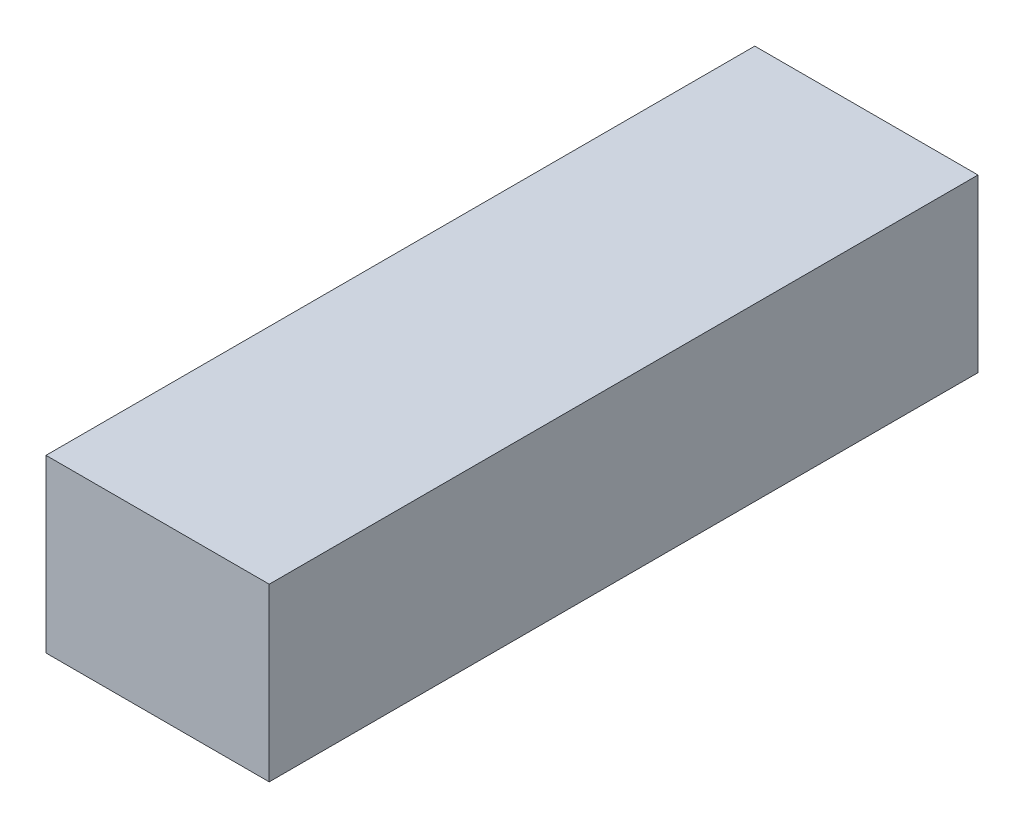
ISO-10303-21;
HEADER;
FILE_DESCRIPTION(('STEP AP214'),'2;1');
FILE_NAME('part.step','',(''),(''),'','','');
FILE_SCHEMA(('AUTOMOTIVE_DESIGN { 1 0 10303 214 1 1 1 1 }'));
ENDSEC;
DATA;
#1=APPLICATION_CONTEXT('core data for automotive mechanical design processes');
#2=APPLICATION_PROTOCOL_DEFINITION('international standard','automotive_design',2000,#1);
#3=PRODUCT_CONTEXT('',#1,'mechanical');
#4=PRODUCT('Part','Part','',(#3));
#5=PRODUCT_RELATED_PRODUCT_CATEGORY('part','',(#4));
#6=PRODUCT_DEFINITION_FORMATION('','',#4);
#7=PRODUCT_DEFINITION_CONTEXT('part definition',#1,'design');
#8=PRODUCT_DEFINITION('design','',#6,#7);
#9=PRODUCT_DEFINITION_SHAPE('','',#8);
#10=(LENGTH_UNIT() NAMED_UNIT(*) SI_UNIT(.MILLI.,.METRE.));
#11=(NAMED_UNIT(*) PLANE_ANGLE_UNIT() SI_UNIT($,.RADIAN.));
#12=(NAMED_UNIT(*) SI_UNIT($,.STERADIAN.) SOLID_ANGLE_UNIT());
#13=UNCERTAINTY_MEASURE_WITH_UNIT(LENGTH_MEASURE(1.E-05),#10,'distance_accuracy_value','');
#14=(GEOMETRIC_REPRESENTATION_CONTEXT(3) GLOBAL_UNCERTAINTY_ASSIGNED_CONTEXT((#13)) GLOBAL_UNIT_ASSIGNED_CONTEXT((#10,
#11,#12)) REPRESENTATION_CONTEXT('',''));
#15=CARTESIAN_POINT('',(0.,0.,0.));
#16=DIRECTION('',(0.,0.,1.));
#17=DIRECTION('',(1.,0.,0.));
#18=AXIS2_PLACEMENT_3D('',#15,#16,#17);
#19=CARTESIAN_POINT('',(24.25,-18.6,154.));
#20=DIRECTION('',(-1.,0.,0.));
#21=DIRECTION('',(0.,0.,1.));
#22=AXIS2_PLACEMENT_3D('',#19,#20,#21);
#23=PLANE('',#22);
#24=DIRECTION('',(0.,1.,0.));
#25=VECTOR('',#24,1.);
#26=CARTESIAN_POINT('',(24.25,-18.6,0.));
#27=LINE('',#26,#25);
#28=CARTESIAN_POINT('',(24.25,-18.6,0.));
#29=VERTEX_POINT('',#28);
#30=CARTESIAN_POINT('',(24.25,18.6,0.));
#31=VERTEX_POINT('',#30);
#32=EDGE_CURVE('E95',#29,#31,#27,.T.);
#33=ORIENTED_EDGE('',*,*,#32,.T.);
#34=DIRECTION('',(0.,0.,-1.));
#35=VECTOR('',#34,1.);
#36=CARTESIAN_POINT('',(24.25,18.6,154.));
#37=LINE('',#36,#35);
#38=CARTESIAN_POINT('',(24.25,18.6,154.));
#39=VERTEX_POINT('',#38);
#40=EDGE_CURVE('E11',#39,#31,#37,.T.);
#41=ORIENTED_EDGE('',*,*,#40,.F.);
#42=DIRECTION('',(0.,1.,0.));
#43=VECTOR('',#42,1.);
#44=CARTESIAN_POINT('',(24.25,-18.6,154.));
#45=LINE('',#44,#43);
#46=CARTESIAN_POINT('',(24.25,-18.6,154.));
#47=VERTEX_POINT('',#46);
#48=EDGE_CURVE('E83',#47,#39,#45,.T.);
#49=ORIENTED_EDGE('',*,*,#48,.F.);
#50=DIRECTION('',(0.,0.,-1.));
#51=VECTOR('',#50,1.);
#52=CARTESIAN_POINT('',(24.25,-18.6,154.));
#53=LINE('',#52,#51);
#54=EDGE_CURVE('E91',#47,#29,#53,.T.);
#55=ORIENTED_EDGE('',*,*,#54,.T.);
#56=EDGE_LOOP('',(#33,#41,#49,#55));
#57=FACE_BOUND('',#56,.T.);
#58=ADVANCED_FACE('F32',(#57),#23,.F.);
#59=CARTESIAN_POINT('',(-24.25,18.6,154.));
#60=DIRECTION('',(0.,-1.,0.));
#61=DIRECTION('',(0.,0.,-1.));
#62=AXIS2_PLACEMENT_3D('',#59,#60,#61);
#63=PLANE('',#62);
#64=DIRECTION('',(-1.,0.,0.));
#65=VECTOR('',#64,1.);
#66=CARTESIAN_POINT('',(-24.25,18.6,0.));
#67=LINE('',#66,#65);
#68=CARTESIAN_POINT('',(-24.25,18.6,0.));
#69=VERTEX_POINT('',#68);
#70=EDGE_CURVE('E87',#31,#69,#67,.T.);
#71=ORIENTED_EDGE('',*,*,#70,.T.);
#72=DIRECTION('',(0.,0.,-1.));
#73=VECTOR('',#72,1.);
#74=CARTESIAN_POINT('',(-24.25,18.6,154.));
#75=LINE('',#74,#73);
#76=CARTESIAN_POINT('',(-24.25,18.6,154.));
#77=VERTEX_POINT('',#76);
#78=EDGE_CURVE('E40',#77,#69,#75,.T.);
#79=ORIENTED_EDGE('',*,*,#78,.F.);
#80=DIRECTION('',(-1.,0.,0.));
#81=VECTOR('',#80,1.);
#82=CARTESIAN_POINT('',(-24.25,18.6,154.));
#83=LINE('',#82,#81);
#84=EDGE_CURVE('E78',#39,#77,#83,.T.);
#85=ORIENTED_EDGE('',*,*,#84,.F.);
#86=ORIENTED_EDGE('',*,*,#40,.T.);
#87=EDGE_LOOP('',(#71,#79,#85,#86));
#88=FACE_BOUND('',#87,.T.);
#89=ADVANCED_FACE('F86',(#88),#63,.F.);
#90=CARTESIAN_POINT('',(-24.25,-18.6,154.));
#91=DIRECTION('',(1.,0.,0.));
#92=DIRECTION('',(0.,0.,-1.));
#93=AXIS2_PLACEMENT_3D('',#90,#91,#92);
#94=PLANE('',#93);
#95=DIRECTION('',(0.,-1.,0.));
#96=VECTOR('',#95,1.);
#97=CARTESIAN_POINT('',(-24.25,-18.6,0.));
#98=LINE('',#97,#96);
#99=CARTESIAN_POINT('',(-24.25,-18.6,0.));
#100=VERTEX_POINT('',#99);
#101=EDGE_CURVE('E65',#69,#100,#98,.T.);
#102=ORIENTED_EDGE('',*,*,#101,.T.);
#103=DIRECTION('',(0.,0.,-1.));
#104=VECTOR('',#103,1.);
#105=CARTESIAN_POINT('',(-24.25,-18.6,154.));
#106=LINE('',#105,#104);
#107=CARTESIAN_POINT('',(-24.25,-18.6,154.));
#108=VERTEX_POINT('',#107);
#109=EDGE_CURVE('E88',#108,#100,#106,.T.);
#110=ORIENTED_EDGE('',*,*,#109,.F.);
#111=DIRECTION('',(0.,-1.,0.));
#112=VECTOR('',#111,1.);
#113=CARTESIAN_POINT('',(-24.25,-18.6,154.));
#114=LINE('',#113,#112);
#115=EDGE_CURVE('E81',#77,#108,#114,.T.);
#116=ORIENTED_EDGE('',*,*,#115,.F.);
#117=ORIENTED_EDGE('',*,*,#78,.T.);
#118=EDGE_LOOP('',(#102,#110,#116,#117));
#119=FACE_BOUND('',#118,.T.);
#120=ADVANCED_FACE('F89',(#119),#94,.F.);
#121=CARTESIAN_POINT('',(-24.25,-18.6,154.));
#122=DIRECTION('',(0.,1.,0.));
#123=DIRECTION('',(0.,0.,1.));
#124=AXIS2_PLACEMENT_3D('',#121,#122,#123);
#125=PLANE('',#124);
#126=DIRECTION('',(1.,0.,0.));
#127=VECTOR('',#126,1.);
#128=CARTESIAN_POINT('',(-24.25,-18.6,0.));
#129=LINE('',#128,#127);
#130=EDGE_CURVE('E71',#100,#29,#129,.T.);
#131=ORIENTED_EDGE('',*,*,#130,.T.);
#132=ORIENTED_EDGE('',*,*,#54,.F.);
#133=DIRECTION('',(1.,0.,0.));
#134=VECTOR('',#133,1.);
#135=CARTESIAN_POINT('',(-24.25,-18.6,154.));
#136=LINE('',#135,#134);
#137=EDGE_CURVE('E48',#108,#47,#136,.T.);
#138=ORIENTED_EDGE('',*,*,#137,.F.);
#139=ORIENTED_EDGE('',*,*,#109,.T.);
#140=EDGE_LOOP('',(#131,#132,#138,#139));
#141=FACE_BOUND('',#140,.T.);
#142=ADVANCED_FACE('F102',(#141),#125,.F.);
#143=CARTESIAN_POINT('',(0.,0.,154.));
#144=DIRECTION('',(0.,0.,-1.));
#145=DIRECTION('',(-1.,0.,0.));
#146=AXIS2_PLACEMENT_3D('',#143,#144,#145);
#147=PLANE('',#146);
#148=ORIENTED_EDGE('',*,*,#48,.T.);
#149=ORIENTED_EDGE('',*,*,#84,.T.);
#150=ORIENTED_EDGE('',*,*,#115,.T.);
#151=ORIENTED_EDGE('',*,*,#137,.T.);
#152=EDGE_LOOP('',(#148,#149,#150,#151));
#153=FACE_BOUND('',#152,.T.);
#154=ADVANCED_FACE('F79',(#153),#147,.F.);
#155=CARTESIAN_POINT('',(0.,0.,0.));
#156=DIRECTION('',(0.,0.,-1.));
#157=DIRECTION('',(-1.,0.,0.));
#158=AXIS2_PLACEMENT_3D('',#155,#156,#157);
#159=PLANE('',#158);
#160=ORIENTED_EDGE('',*,*,#32,.F.);
#161=ORIENTED_EDGE('',*,*,#130,.F.);
#162=ORIENTED_EDGE('',*,*,#101,.F.);
#163=ORIENTED_EDGE('',*,*,#70,.F.);
#164=EDGE_LOOP('',(#160,#161,#162,#163));
#165=FACE_BOUND('',#164,.T.);
#166=ADVANCED_FACE('F105',(#165),#159,.T.);
#167=CLOSED_SHELL('',(#58,#89,#120,#142,#154,#166));
#168=MANIFOLD_SOLID_BREP('B2',#167);
#169=ADVANCED_BREP_SHAPE_REPRESENTATION('',(#18,#168),#14);
#170=SHAPE_DEFINITION_REPRESENTATION(#9,#169);
ENDSEC;
END-ISO-10303-21;
